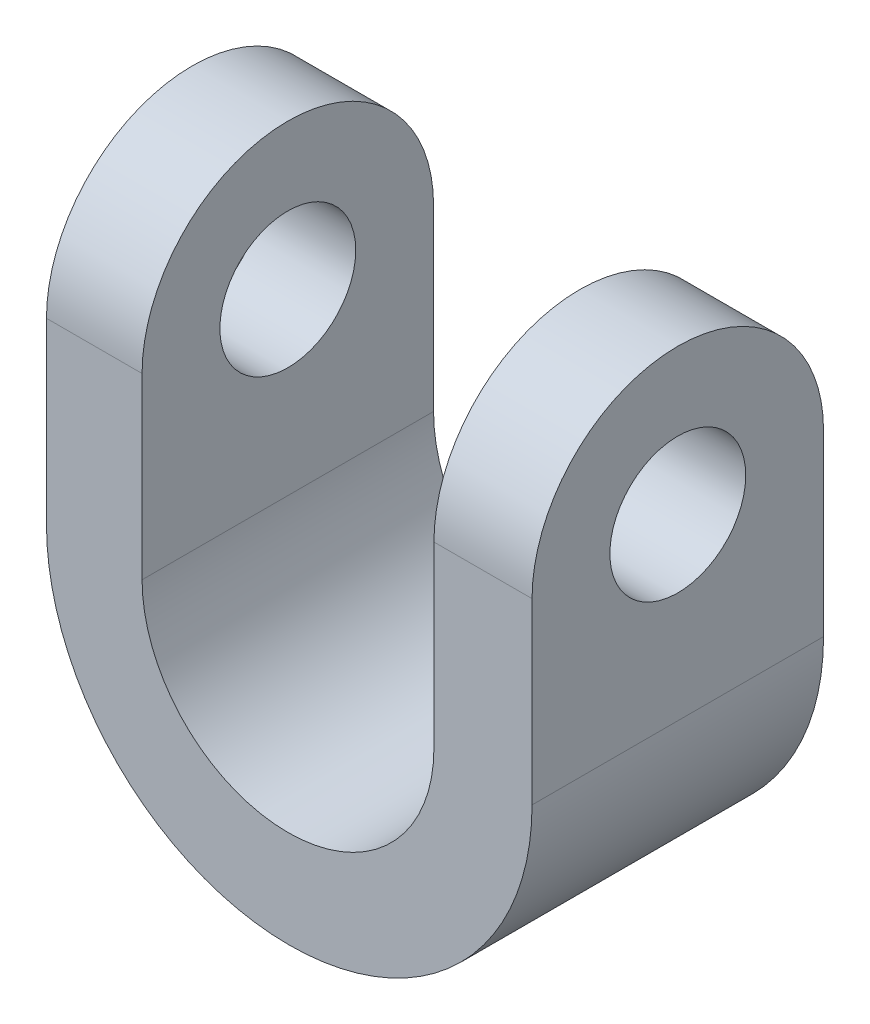
ISO-10303-21;
HEADER;
FILE_DESCRIPTION(('STEP AP214'),'2;1');
FILE_NAME('part.step','',(''),(''),'','','');
FILE_SCHEMA(('AUTOMOTIVE_DESIGN { 1 0 10303 214 1 1 1 1 }'));
ENDSEC;
DATA;
#1=APPLICATION_CONTEXT('core data for automotive mechanical design processes');
#2=APPLICATION_PROTOCOL_DEFINITION('international standard','automotive_design',2000,#1);
#3=PRODUCT_CONTEXT('',#1,'mechanical');
#4=PRODUCT('Part','Part','',(#3));
#5=PRODUCT_RELATED_PRODUCT_CATEGORY('part','',(#4));
#6=PRODUCT_DEFINITION_FORMATION('','',#4);
#7=PRODUCT_DEFINITION_CONTEXT('part definition',#1,'design');
#8=PRODUCT_DEFINITION('design','',#6,#7);
#9=PRODUCT_DEFINITION_SHAPE('','',#8);
#10=(LENGTH_UNIT() NAMED_UNIT(*) SI_UNIT(.MILLI.,.METRE.));
#11=(NAMED_UNIT(*) PLANE_ANGLE_UNIT() SI_UNIT($,.RADIAN.));
#12=(NAMED_UNIT(*) SI_UNIT($,.STERADIAN.) SOLID_ANGLE_UNIT());
#13=UNCERTAINTY_MEASURE_WITH_UNIT(LENGTH_MEASURE(1.E-05),#10,'distance_accuracy_value','');
#14=(GEOMETRIC_REPRESENTATION_CONTEXT(3) GLOBAL_UNCERTAINTY_ASSIGNED_CONTEXT((#13)) GLOBAL_UNIT_ASSIGNED_CONTEXT((#10,
#11,#12)) REPRESENTATION_CONTEXT('',''));
#15=CARTESIAN_POINT('',(0.,0.,0.));
#16=DIRECTION('',(0.,0.,1.));
#17=DIRECTION('',(1.,0.,0.));
#18=AXIS2_PLACEMENT_3D('',#15,#16,#17);
#19=CARTESIAN_POINT('',(-2.42291933418694,-18.2820277034105,-80.));
#20=DIRECTION('',(0.,0.,1.));
#21=DIRECTION('',(1.,0.,0.));
#22=AXIS2_PLACEMENT_3D('',#19,#20,#21);
#23=CYLINDRICAL_SURFACE('',#22,42.5112210452799);
#24=DIRECTION('',(0.,0.,1.));
#25=VECTOR('',#24,1.);
#26=CARTESIAN_POINT('',(-44.9341403794669,-18.2820277034105,-80.));
#27=LINE('',#26,#25);
#28=CARTESIAN_POINT('',(-44.9341403794669,-18.2820277034106,-65.5185871034266));
#29=VERTEX_POINT('',#28);
#30=CARTESIAN_POINT('',(-44.9341403794669,-18.2820277034106,-14.4814128965734));
#31=VERTEX_POINT('',#30);
#32=EDGE_CURVE('E112',#29,#31,#27,.T.);
#33=ORIENTED_EDGE('',*,*,#32,.F.);
#34=CARTESIAN_POINT('',(-2.42291933418694,-18.2820277034105,-65.5185871034266));
#35=DIRECTION('',(0.,0.,-1.));
#36=DIRECTION('',(-1.,0.,0.));
#37=AXIS2_PLACEMENT_3D('',#34,#35,#36);
#38=CIRCLE('',#37,42.5112210452799);
#39=CARTESIAN_POINT('',(40.088301711093,-18.2820277034106,-65.5185871034266));
#40=VERTEX_POINT('',#39);
#41=EDGE_CURVE('E107',#29,#40,#38,.F.);
#42=ORIENTED_EDGE('',*,*,#41,.T.);
#43=DIRECTION('',(0.,0.,1.));
#44=VECTOR('',#43,1.);
#45=CARTESIAN_POINT('',(40.088301711093,-18.2820277034105,-80.));
#46=LINE('',#45,#44);
#47=CARTESIAN_POINT('',(40.088301711093,-18.2820277034105,-14.4814128965734));
#48=VERTEX_POINT('',#47);
#49=EDGE_CURVE('E110',#40,#48,#46,.T.);
#50=ORIENTED_EDGE('',*,*,#49,.T.);
#51=CARTESIAN_POINT('',(-2.42291933418694,-18.2820277034105,-14.4814128965734));
#52=DIRECTION('',(0.,0.,1.));
#53=DIRECTION('',(1.,0.,0.));
#54=AXIS2_PLACEMENT_3D('',#51,#52,#53);
#55=CIRCLE('',#54,42.5112210452799);
#56=EDGE_CURVE('E197',#48,#31,#55,.F.);
#57=ORIENTED_EDGE('',*,*,#56,.T.);
#58=EDGE_LOOP('',(#33,#42,#50,#57));
#59=FACE_BOUND('',#58,.T.);
#60=ADVANCED_FACE('F39',(#59),#23,.T.);
#61=CARTESIAN_POINT('',(-2.64318472820392,-18.2820277034102,-80.));
#62=DIRECTION('',(0.,0.,1.));
#63=DIRECTION('',(1.,0.,0.));
#64=AXIS2_PLACEMENT_3D('',#61,#62,#63);
#65=CYLINDRICAL_SURFACE('',#64,25.5507857059714);
#66=DIRECTION('',(0.,0.,1.));
#67=VECTOR('',#66,1.);
#68=CARTESIAN_POINT('',(22.9076009777675,-18.2820277034102,-80.));
#69=LINE('',#68,#67);
#70=CARTESIAN_POINT('',(22.9076009777675,-18.2820277034105,-65.5185871034266));
#71=VERTEX_POINT('',#70);
#72=CARTESIAN_POINT('',(22.9076009777675,-18.2820277034105,-14.4814128965734));
#73=VERTEX_POINT('',#72);
#74=EDGE_CURVE('E149',#71,#73,#69,.T.);
#75=ORIENTED_EDGE('',*,*,#74,.F.);
#76=CARTESIAN_POINT('',(-2.64318472820392,-18.2820277034102,-65.5185871034266));
#77=DIRECTION('',(0.,0.,-1.));
#78=DIRECTION('',(-1.,0.,0.));
#79=AXIS2_PLACEMENT_3D('',#76,#77,#78);
#80=CIRCLE('',#79,25.5507857059714);
#81=CARTESIAN_POINT('',(-28.1939704341753,-18.2820277034102,-65.5185871034266));
#82=VERTEX_POINT('',#81);
#83=EDGE_CURVE('E117',#71,#82,#80,.T.);
#84=ORIENTED_EDGE('',*,*,#83,.T.);
#85=DIRECTION('',(0.,0.,1.));
#86=VECTOR('',#85,1.);
#87=CARTESIAN_POINT('',(-28.1939704341753,-18.2820277034102,-80.));
#88=LINE('',#87,#86);
#89=CARTESIAN_POINT('',(-28.1939704341753,-18.2820277034105,-14.4814128965734));
#90=VERTEX_POINT('',#89);
#91=EDGE_CURVE('E140',#82,#90,#88,.T.);
#92=ORIENTED_EDGE('',*,*,#91,.T.);
#93=CARTESIAN_POINT('',(-2.64318472820392,-18.2820277034102,-14.4814128965734));
#94=DIRECTION('',(0.,0.,1.));
#95=DIRECTION('',(1.,0.,0.));
#96=AXIS2_PLACEMENT_3D('',#93,#94,#95);
#97=CIRCLE('',#96,25.5507857059714);
#98=EDGE_CURVE('E116',#90,#73,#97,.T.);
#99=ORIENTED_EDGE('',*,*,#98,.T.);
#100=EDGE_LOOP('',(#75,#84,#92,#99));
#101=FACE_BOUND('',#100,.T.);
#102=ADVANCED_FACE('F234',(#101),#65,.F.);
#103=CARTESIAN_POINT('',(40.088301711093,44.2733441974159,-80.));
#104=DIRECTION('',(1.,0.,0.));
#105=DIRECTION('',(0.,0.,-1.));
#106=AXIS2_PLACEMENT_3D('',#103,#104,#105);
#107=PLANE('',#106);
#108=CARTESIAN_POINT('',(40.088301711093,12.9956582470027,-40.));
#109=DIRECTION('',(1.,0.,0.));
#110=DIRECTION('',(0.,0.,-1.));
#111=AXIS2_PLACEMENT_3D('',#108,#109,#110);
#112=CIRCLE('',#111,11.893880872574);
#113=CARTESIAN_POINT('',(40.088301711093,12.9956582470027,-51.893880872574));
#114=VERTEX_POINT('',#113);
#115=EDGE_CURVE('E208',#114,#114,#112,.T.);
#116=ORIENTED_EDGE('',*,*,#115,.F.);
#117=EDGE_LOOP('',(#116));
#118=FACE_BOUND('',#117,.T.);
#119=CARTESIAN_POINT('',(40.088301711093,12.9956582470027,-40.));
#120=DIRECTION('',(1.,0.,0.));
#121=DIRECTION('',(0.,0.,-1.));
#122=AXIS2_PLACEMENT_3D('',#119,#120,#121);
#123=CIRCLE('',#122,25.5185871034266);
#124=CARTESIAN_POINT('',(40.088301711093,12.9956582470027,-65.5185871034266));
#125=VERTEX_POINT('',#124);
#126=CARTESIAN_POINT('',(40.088301711093,12.9956582470027,-14.4814128965734));
#127=VERTEX_POINT('',#126);
#128=EDGE_CURVE('E129',#125,#127,#123,.T.);
#129=ORIENTED_EDGE('',*,*,#128,.T.);
#130=DIRECTION('',(0.,-1.,0.));
#131=VECTOR('',#130,1.);
#132=CARTESIAN_POINT('',(40.088301711093,0.,-14.4814128965734));
#133=LINE('',#132,#131);
#134=EDGE_CURVE('E128',#127,#48,#133,.T.);
#135=ORIENTED_EDGE('',*,*,#134,.T.);
#136=ORIENTED_EDGE('',*,*,#49,.F.);
#137=DIRECTION('',(0.,1.,0.));
#138=VECTOR('',#137,1.);
#139=CARTESIAN_POINT('',(40.088301711093,0.,-65.5185871034266));
#140=LINE('',#139,#138);
#141=EDGE_CURVE('E120',#40,#125,#140,.T.);
#142=ORIENTED_EDGE('',*,*,#141,.T.);
#143=EDGE_LOOP('',(#129,#135,#136,#142));
#144=FACE_BOUND('',#143,.T.);
#145=ADVANCED_FACE('F131',(#118,#144),#107,.T.);
#146=CARTESIAN_POINT('',(-44.9341403794669,-18.2820277034105,-80.));
#147=DIRECTION('',(-1.,0.,0.));
#148=DIRECTION('',(0.,0.,1.));
#149=AXIS2_PLACEMENT_3D('',#146,#147,#148);
#150=PLANE('',#149);
#151=CARTESIAN_POINT('',(-44.9341403794669,12.9956582470027,-40.));
#152=DIRECTION('',(1.,0.,0.));
#153=DIRECTION('',(0.,0.,-1.));
#154=AXIS2_PLACEMENT_3D('',#151,#152,#153);
#155=CIRCLE('',#154,11.893880872574);
#156=CARTESIAN_POINT('',(-44.9341403794669,12.9956582470027,-51.893880872574));
#157=VERTEX_POINT('',#156);
#158=EDGE_CURVE('E212',#157,#157,#155,.T.);
#159=ORIENTED_EDGE('',*,*,#158,.T.);
#160=EDGE_LOOP('',(#159));
#161=FACE_BOUND('',#160,.T.);
#162=ORIENTED_EDGE('',*,*,#32,.T.);
#163=DIRECTION('',(0.,-1.,0.));
#164=VECTOR('',#163,1.);
#165=CARTESIAN_POINT('',(-44.9341403794669,0.,-14.4814128965734));
#166=LINE('',#165,#164);
#167=CARTESIAN_POINT('',(-44.9341403794669,12.9956582470027,-14.4814128965734));
#168=VERTEX_POINT('',#167);
#169=EDGE_CURVE('E186',#168,#31,#166,.T.);
#170=ORIENTED_EDGE('',*,*,#169,.F.);
#171=CARTESIAN_POINT('',(-44.9341403794669,12.9956582470027,-40.));
#172=DIRECTION('',(1.,0.,0.));
#173=DIRECTION('',(0.,0.,-1.));
#174=AXIS2_PLACEMENT_3D('',#171,#172,#173);
#175=CIRCLE('',#174,25.5185871034266);
#176=CARTESIAN_POINT('',(-44.9341403794669,12.9956582470027,-65.5185871034266));
#177=VERTEX_POINT('',#176);
#178=EDGE_CURVE('E187',#177,#168,#175,.T.);
#179=ORIENTED_EDGE('',*,*,#178,.F.);
#180=DIRECTION('',(0.,1.,0.));
#181=VECTOR('',#180,1.);
#182=CARTESIAN_POINT('',(-44.9341403794669,0.,-65.5185871034266));
#183=LINE('',#182,#181);
#184=EDGE_CURVE('E183',#29,#177,#183,.T.);
#185=ORIENTED_EDGE('',*,*,#184,.F.);
#186=EDGE_LOOP('',(#162,#170,#179,#185));
#187=FACE_BOUND('',#186,.T.);
#188=ADVANCED_FACE('F230',(#161,#187),#150,.T.);
#189=CARTESIAN_POINT('',(-28.1939704341753,44.2733441974159,-80.));
#190=DIRECTION('',(1.,0.,0.));
#191=DIRECTION('',(0.,0.,-1.));
#192=AXIS2_PLACEMENT_3D('',#189,#190,#191);
#193=PLANE('',#192);
#194=CARTESIAN_POINT('',(-28.1939704341753,12.9956582470027,-40.));
#195=DIRECTION('',(1.,0.,0.));
#196=DIRECTION('',(0.,0.,-1.));
#197=AXIS2_PLACEMENT_3D('',#194,#195,#196);
#198=CIRCLE('',#197,11.893880872574);
#199=CARTESIAN_POINT('',(-28.1939704341753,12.9956582470027,-51.893880872574));
#200=VERTEX_POINT('',#199);
#201=EDGE_CURVE('E204',#200,#200,#198,.T.);
#202=ORIENTED_EDGE('',*,*,#201,.F.);
#203=EDGE_LOOP('',(#202));
#204=FACE_BOUND('',#203,.T.);
#205=CARTESIAN_POINT('',(-28.1939704341753,12.9956582470027,-40.));
#206=DIRECTION('',(1.,0.,0.));
#207=DIRECTION('',(0.,0.,-1.));
#208=AXIS2_PLACEMENT_3D('',#205,#206,#207);
#209=CIRCLE('',#208,25.5185871034266);
#210=CARTESIAN_POINT('',(-28.1939704341753,12.9956582470027,-65.5185871034266));
#211=VERTEX_POINT('',#210);
#212=CARTESIAN_POINT('',(-28.1939704341753,12.9956582470027,-14.4814128965734));
#213=VERTEX_POINT('',#212);
#214=EDGE_CURVE('E143',#211,#213,#209,.T.);
#215=ORIENTED_EDGE('',*,*,#214,.T.);
#216=DIRECTION('',(0.,-1.,0.));
#217=VECTOR('',#216,1.);
#218=CARTESIAN_POINT('',(-28.1939704341753,44.2733441974159,-14.4814128965734));
#219=LINE('',#218,#217);
#220=EDGE_CURVE('E62',#213,#90,#219,.T.);
#221=ORIENTED_EDGE('',*,*,#220,.T.);
#222=ORIENTED_EDGE('',*,*,#91,.F.);
#223=DIRECTION('',(0.,1.,0.));
#224=VECTOR('',#223,1.);
#225=CARTESIAN_POINT('',(-28.1939704341753,44.2733441974159,-65.5185871034266));
#226=LINE('',#225,#224);
#227=EDGE_CURVE('E165',#82,#211,#226,.T.);
#228=ORIENTED_EDGE('',*,*,#227,.T.);
#229=EDGE_LOOP('',(#215,#221,#222,#228));
#230=FACE_BOUND('',#229,.T.);
#231=ADVANCED_FACE('F177',(#204,#230),#193,.T.);
#232=CARTESIAN_POINT('',(22.9076009777675,-18.2820277034102,-80.));
#233=DIRECTION('',(-1.,0.,0.));
#234=DIRECTION('',(0.,0.,1.));
#235=AXIS2_PLACEMENT_3D('',#232,#233,#234);
#236=PLANE('',#235);
#237=CARTESIAN_POINT('',(22.9076009777675,12.9956582470027,-40.));
#238=DIRECTION('',(-1.,0.,0.));
#239=DIRECTION('',(0.,0.,1.));
#240=AXIS2_PLACEMENT_3D('',#237,#238,#239);
#241=CIRCLE('',#240,11.893880872574);
#242=CARTESIAN_POINT('',(22.9076009777675,12.9956582470027,-28.106119127426));
#243=VERTEX_POINT('',#242);
#244=EDGE_CURVE('E43',#243,#243,#241,.T.);
#245=ORIENTED_EDGE('',*,*,#244,.F.);
#246=EDGE_LOOP('',(#245));
#247=FACE_BOUND('',#246,.T.);
#248=ORIENTED_EDGE('',*,*,#74,.T.);
#249=DIRECTION('',(0.,1.,0.));
#250=VECTOR('',#249,1.);
#251=CARTESIAN_POINT('',(22.9076009777675,-18.2820277034103,-14.4814128965734));
#252=LINE('',#251,#250);
#253=CARTESIAN_POINT('',(22.9076009777675,12.9956582470027,-14.4814128965734));
#254=VERTEX_POINT('',#253);
#255=EDGE_CURVE('E11',#73,#254,#252,.T.);
#256=ORIENTED_EDGE('',*,*,#255,.T.);
#257=CARTESIAN_POINT('',(22.9076009777675,12.9956582470027,-40.));
#258=DIRECTION('',(-1.,0.,0.));
#259=DIRECTION('',(0.,0.,1.));
#260=AXIS2_PLACEMENT_3D('',#257,#258,#259);
#261=CIRCLE('',#260,25.5185871034266);
#262=CARTESIAN_POINT('',(22.9076009777675,12.9956582470027,-65.5185871034266));
#263=VERTEX_POINT('',#262);
#264=EDGE_CURVE('E49',#254,#263,#261,.T.);
#265=ORIENTED_EDGE('',*,*,#264,.T.);
#266=DIRECTION('',(0.,-1.,0.));
#267=VECTOR('',#266,1.);
#268=CARTESIAN_POINT('',(22.9076009777675,-18.2820277034102,-65.5185871034266));
#269=LINE('',#268,#267);
#270=EDGE_CURVE('E135',#263,#71,#269,.T.);
#271=ORIENTED_EDGE('',*,*,#270,.T.);
#272=EDGE_LOOP('',(#248,#256,#265,#271));
#273=FACE_BOUND('',#272,.T.);
#274=ADVANCED_FACE('F41',(#247,#273),#236,.T.);
#275=CARTESIAN_POINT('',(-44.9341403794669,0.,-14.4814128965734));
#276=DIRECTION('',(0.,0.,1.));
#277=DIRECTION('',(0.,-1.,0.));
#278=AXIS2_PLACEMENT_3D('',#275,#276,#277);
#279=PLANE('',#278);
#280=ORIENTED_EDGE('',*,*,#98,.F.);
#281=ORIENTED_EDGE('',*,*,#220,.F.);
#282=DIRECTION('',(1.,0.,0.));
#283=VECTOR('',#282,1.);
#284=CARTESIAN_POINT('',(-44.9341403794669,12.9956582470027,-14.4814128965734));
#285=LINE('',#284,#283);
#286=EDGE_CURVE('E160',#168,#213,#285,.T.);
#287=ORIENTED_EDGE('',*,*,#286,.F.);
#288=ORIENTED_EDGE('',*,*,#169,.T.);
#289=ORIENTED_EDGE('',*,*,#56,.F.);
#290=ORIENTED_EDGE('',*,*,#134,.F.);
#291=EDGE_CURVE('E157',#254,#127,#285,.T.);
#292=ORIENTED_EDGE('',*,*,#291,.F.);
#293=ORIENTED_EDGE('',*,*,#255,.F.);
#294=EDGE_LOOP('',(#280,#281,#287,#288,#289,#290,#292,#293));
#295=FACE_BOUND('',#294,.T.);
#296=ADVANCED_FACE('F158',(#295),#279,.T.);
#297=CARTESIAN_POINT('',(-44.9341403794669,0.,-65.5185871034266));
#298=DIRECTION('',(0.,0.,-1.));
#299=DIRECTION('',(-1.,0.,0.));
#300=AXIS2_PLACEMENT_3D('',#297,#298,#299);
#301=PLANE('',#300);
#302=ORIENTED_EDGE('',*,*,#184,.T.);
#303=DIRECTION('',(1.,0.,0.));
#304=VECTOR('',#303,1.);
#305=CARTESIAN_POINT('',(-44.9341403794669,12.9956582470027,-65.5185871034266));
#306=LINE('',#305,#304);
#307=EDGE_CURVE('E161',#177,#211,#306,.T.);
#308=ORIENTED_EDGE('',*,*,#307,.T.);
#309=ORIENTED_EDGE('',*,*,#227,.F.);
#310=ORIENTED_EDGE('',*,*,#83,.F.);
#311=ORIENTED_EDGE('',*,*,#270,.F.);
#312=EDGE_CURVE('E123',#263,#125,#306,.T.);
#313=ORIENTED_EDGE('',*,*,#312,.T.);
#314=ORIENTED_EDGE('',*,*,#141,.F.);
#315=ORIENTED_EDGE('',*,*,#41,.F.);
#316=EDGE_LOOP('',(#302,#308,#309,#310,#311,#313,#314,#315));
#317=FACE_BOUND('',#316,.T.);
#318=ADVANCED_FACE('F121',(#317),#301,.T.);
#319=CARTESIAN_POINT('',(-44.9341403794669,12.9956582470027,-40.));
#320=DIRECTION('',(1.,0.,0.));
#321=DIRECTION('',(0.,0.,-1.));
#322=AXIS2_PLACEMENT_3D('',#319,#320,#321);
#323=CYLINDRICAL_SURFACE('',#322,25.5185871034266);
#324=ORIENTED_EDGE('',*,*,#307,.F.);
#325=ORIENTED_EDGE('',*,*,#178,.T.);
#326=ORIENTED_EDGE('',*,*,#286,.T.);
#327=ORIENTED_EDGE('',*,*,#214,.F.);
#328=EDGE_LOOP('',(#324,#325,#326,#327));
#329=FACE_BOUND('',#328,.T.);
#330=ADVANCED_FACE('F181',(#329),#323,.T.);
#331=ORIENTED_EDGE('',*,*,#291,.T.);
#332=ORIENTED_EDGE('',*,*,#128,.F.);
#333=ORIENTED_EDGE('',*,*,#312,.F.);
#334=ORIENTED_EDGE('',*,*,#264,.F.);
#335=EDGE_LOOP('',(#331,#332,#333,#334));
#336=FACE_BOUND('',#335,.T.);
#337=ADVANCED_FACE('F156',(#336),#323,.T.);
#338=CARTESIAN_POINT('',(-44.9341403794669,12.9956582470027,-40.));
#339=DIRECTION('',(1.,0.,0.));
#340=DIRECTION('',(0.,0.,-1.));
#341=AXIS2_PLACEMENT_3D('',#338,#339,#340);
#342=CYLINDRICAL_SURFACE('',#341,11.893880872574);
#343=ORIENTED_EDGE('',*,*,#244,.T.);
#344=EDGE_LOOP('',(#343));
#345=FACE_BOUND('',#344,.T.);
#346=ORIENTED_EDGE('',*,*,#115,.T.);
#347=EDGE_LOOP('',(#346));
#348=FACE_BOUND('',#347,.T.);
#349=ADVANCED_FACE('F221',(#345,#348),#342,.F.);
#350=ORIENTED_EDGE('',*,*,#201,.T.);
#351=EDGE_LOOP('',(#350));
#352=FACE_BOUND('',#351,.T.);
#353=ORIENTED_EDGE('',*,*,#158,.F.);
#354=EDGE_LOOP('',(#353));
#355=FACE_BOUND('',#354,.T.);
#356=ADVANCED_FACE('F253',(#352,#355),#342,.F.);
#357=CLOSED_SHELL('',(#60,#102,#145,#188,#231,#274,#296,#318,#330,#337,#349,#356));
#358=MANIFOLD_SOLID_BREP('B2',#357);
#359=ADVANCED_BREP_SHAPE_REPRESENTATION('',(#18,#358),#14);
#360=SHAPE_DEFINITION_REPRESENTATION(#9,#359);
ENDSEC;
END-ISO-10303-21;
